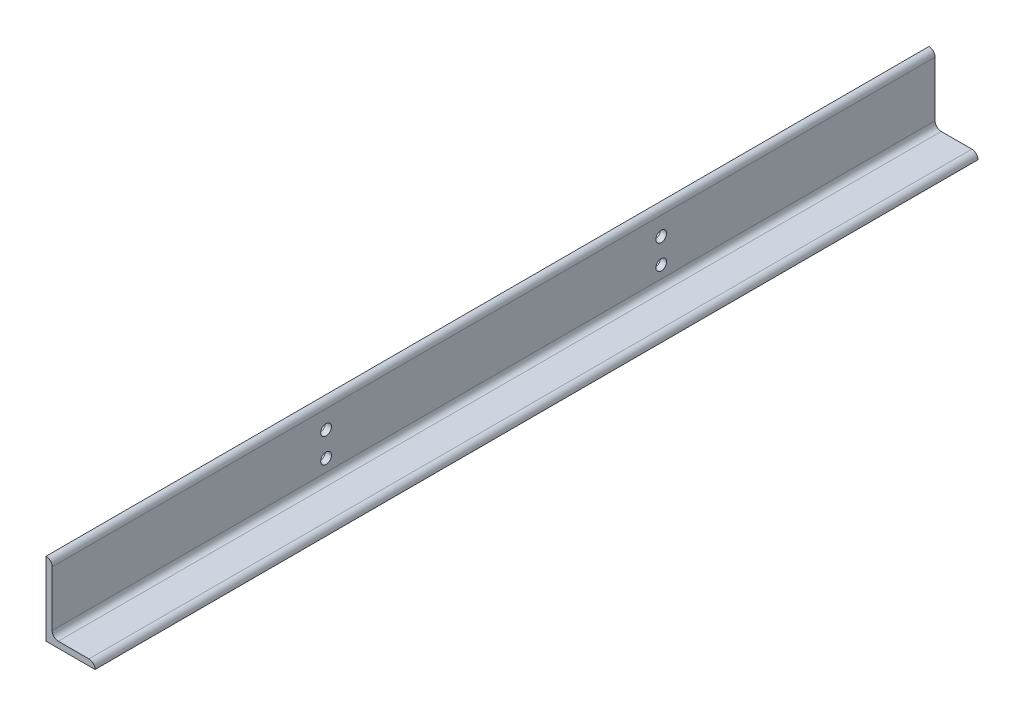
ISO-10303-21;
HEADER;
FILE_DESCRIPTION(('STEP AP214'),'2;1');
FILE_NAME('part.step','',(''),(''),'','','');
FILE_SCHEMA(('AUTOMOTIVE_DESIGN { 1 0 10303 214 1 1 1 1 }'));
ENDSEC;
DATA;
#1=APPLICATION_CONTEXT('core data for automotive mechanical design processes');
#2=APPLICATION_PROTOCOL_DEFINITION('international standard','automotive_design',2000,#1);
#3=PRODUCT_CONTEXT('',#1,'mechanical');
#4=PRODUCT('Part','Part','',(#3));
#5=PRODUCT_RELATED_PRODUCT_CATEGORY('part','',(#4));
#6=PRODUCT_DEFINITION_FORMATION('','',#4);
#7=PRODUCT_DEFINITION_CONTEXT('part definition',#1,'design');
#8=PRODUCT_DEFINITION('design','',#6,#7);
#9=PRODUCT_DEFINITION_SHAPE('','',#8);
#10=(LENGTH_UNIT() NAMED_UNIT(*) SI_UNIT(.MILLI.,.METRE.));
#11=(NAMED_UNIT(*) PLANE_ANGLE_UNIT() SI_UNIT($,.RADIAN.));
#12=(NAMED_UNIT(*) SI_UNIT($,.STERADIAN.) SOLID_ANGLE_UNIT());
#13=UNCERTAINTY_MEASURE_WITH_UNIT(LENGTH_MEASURE(1.E-05),#10,'distance_accuracy_value','');
#14=(GEOMETRIC_REPRESENTATION_CONTEXT(3) GLOBAL_UNCERTAINTY_ASSIGNED_CONTEXT((#13)) GLOBAL_UNIT_ASSIGNED_CONTEXT((#10,
#11,#12)) REPRESENTATION_CONTEXT('',''));
#15=CARTESIAN_POINT('',(0.,0.,0.));
#16=DIRECTION('',(0.,0.,1.));
#17=DIRECTION('',(1.,0.,0.));
#18=AXIS2_PLACEMENT_3D('',#15,#16,#17);
#19=CARTESIAN_POINT('',(101.6,0.,914.4));
#20=DIRECTION('',(0.,1.,0.));
#21=DIRECTION('',(-1.,0.,0.));
#22=AXIS2_PLACEMENT_3D('',#19,#20,#21);
#23=PLANE('',#22);
#24=DIRECTION('',(1.,0.,0.));
#25=VECTOR('',#24,1.);
#26=CARTESIAN_POINT('',(101.6,0.,-914.4));
#27=LINE('',#26,#25);
#28=CARTESIAN_POINT('',(0.,0.,-914.4));
#29=VERTEX_POINT('',#28);
#30=CARTESIAN_POINT('',(101.6,0.,-914.4));
#31=VERTEX_POINT('',#30);
#32=EDGE_CURVE('E137',#29,#31,#27,.T.);
#33=ORIENTED_EDGE('',*,*,#32,.T.);
#34=DIRECTION('',(0.,0.,-1.));
#35=VECTOR('',#34,1.);
#36=CARTESIAN_POINT('',(101.6,0.,914.4));
#37=LINE('',#36,#35);
#38=CARTESIAN_POINT('',(101.6,0.,914.4));
#39=VERTEX_POINT('',#38);
#40=EDGE_CURVE('E11',#39,#31,#37,.T.);
#41=ORIENTED_EDGE('',*,*,#40,.F.);
#42=DIRECTION('',(1.,0.,0.));
#43=VECTOR('',#42,1.);
#44=CARTESIAN_POINT('',(101.6,0.,914.4));
#45=LINE('',#44,#43);
#46=CARTESIAN_POINT('',(0.,0.,914.4));
#47=VERTEX_POINT('',#46);
#48=EDGE_CURVE('E154',#47,#39,#45,.T.);
#49=ORIENTED_EDGE('',*,*,#48,.F.);
#50=DIRECTION('',(0.,0.,-1.));
#51=VECTOR('',#50,1.);
#52=CARTESIAN_POINT('',(0.,0.,914.4));
#53=LINE('',#52,#51);
#54=EDGE_CURVE('E133',#47,#29,#53,.T.);
#55=ORIENTED_EDGE('',*,*,#54,.T.);
#56=EDGE_LOOP('',(#33,#41,#49,#55));
#57=FACE_BOUND('',#56,.T.);
#58=ADVANCED_FACE('F35',(#57),#23,.F.);
#59=CARTESIAN_POINT('',(101.6,0.00508000000000622,914.4));
#60=DIRECTION('',(-1.,0.,0.));
#61=DIRECTION('',(0.,0.,1.));
#62=AXIS2_PLACEMENT_3D('',#59,#60,#61);
#63=PLANE('',#62);
#64=DIRECTION('',(0.,1.,0.));
#65=VECTOR('',#64,1.);
#66=CARTESIAN_POINT('',(101.6,0.00508000000000622,-914.4));
#67=LINE('',#66,#65);
#68=CARTESIAN_POINT('',(101.6,0.00508000000000622,-914.4));
#69=VERTEX_POINT('',#68);
#70=EDGE_CURVE('E140',#31,#69,#67,.T.);
#71=ORIENTED_EDGE('',*,*,#70,.T.);
#72=DIRECTION('',(0.,0.,-1.));
#73=VECTOR('',#72,1.);
#74=CARTESIAN_POINT('',(101.6,0.00508000000000622,914.4));
#75=LINE('',#74,#73);
#76=CARTESIAN_POINT('',(101.6,0.00508000000000622,914.4));
#77=VERTEX_POINT('',#76);
#78=EDGE_CURVE('E43',#77,#69,#75,.T.);
#79=ORIENTED_EDGE('',*,*,#78,.F.);
#80=DIRECTION('',(0.,1.,0.));
#81=VECTOR('',#80,1.);
#82=CARTESIAN_POINT('',(101.6,0.00508000000000622,914.4));
#83=LINE('',#82,#81);
#84=EDGE_CURVE('E97',#39,#77,#83,.T.);
#85=ORIENTED_EDGE('',*,*,#84,.F.);
#86=ORIENTED_EDGE('',*,*,#40,.T.);
#87=EDGE_LOOP('',(#71,#79,#85,#86));
#88=FACE_BOUND('',#87,.T.);
#89=ADVANCED_FACE('F247',(#88),#63,.F.);
#90=CARTESIAN_POINT('',(88.90508,0.00508000000000467,914.4));
#91=DIRECTION('',(0.,0.,-1.));
#92=DIRECTION('',(-1.,0.,0.));
#93=AXIS2_PLACEMENT_3D('',#90,#91,#92);
#94=CYLINDRICAL_SURFACE('',#93,12.69492);
#95=CARTESIAN_POINT('',(88.90508,0.00508000000000467,-914.4));
#96=DIRECTION('',(0.,0.,1.));
#97=DIRECTION('',(1.,0.,0.));
#98=AXIS2_PLACEMENT_3D('',#95,#96,#97);
#99=CIRCLE('',#98,12.69492);
#100=CARTESIAN_POINT('',(88.90508,12.7,-914.4));
#101=VERTEX_POINT('',#100);
#102=EDGE_CURVE('E143',#69,#101,#99,.T.);
#103=ORIENTED_EDGE('',*,*,#102,.T.);
#104=DIRECTION('',(0.,0.,-1.));
#105=VECTOR('',#104,1.);
#106=CARTESIAN_POINT('',(88.90508,12.7,914.4));
#107=LINE('',#106,#105);
#108=CARTESIAN_POINT('',(88.90508,12.7,914.4));
#109=VERTEX_POINT('',#108);
#110=EDGE_CURVE('E164',#109,#101,#107,.T.);
#111=ORIENTED_EDGE('',*,*,#110,.F.);
#112=CARTESIAN_POINT('',(88.90508,0.00508000000000467,914.4));
#113=DIRECTION('',(0.,0.,1.));
#114=DIRECTION('',(1.,0.,0.));
#115=AXIS2_PLACEMENT_3D('',#112,#113,#114);
#116=CIRCLE('',#115,12.69492);
#117=EDGE_CURVE('E172',#77,#109,#116,.T.);
#118=ORIENTED_EDGE('',*,*,#117,.F.);
#119=ORIENTED_EDGE('',*,*,#78,.T.);
#120=EDGE_LOOP('',(#103,#111,#118,#119));
#121=FACE_BOUND('',#120,.T.);
#122=ADVANCED_FACE('F170',(#121),#94,.T.);
#123=CARTESIAN_POINT('',(25.4,12.7,914.4));
#124=DIRECTION('',(0.,-1.,0.));
#125=DIRECTION('',(0.,0.,-1.));
#126=AXIS2_PLACEMENT_3D('',#123,#124,#125);
#127=PLANE('',#126);
#128=DIRECTION('',(-1.,0.,0.));
#129=VECTOR('',#128,1.);
#130=CARTESIAN_POINT('',(25.4,12.7,-914.4));
#131=LINE('',#130,#129);
#132=CARTESIAN_POINT('',(25.4,12.7,-914.4));
#133=VERTEX_POINT('',#132);
#134=EDGE_CURVE('E145',#101,#133,#131,.T.);
#135=ORIENTED_EDGE('',*,*,#134,.T.);
#136=DIRECTION('',(0.,0.,-1.));
#137=VECTOR('',#136,1.);
#138=CARTESIAN_POINT('',(25.4,12.7,914.4));
#139=LINE('',#138,#137);
#140=CARTESIAN_POINT('',(25.4,12.7,914.4));
#141=VERTEX_POINT('',#140);
#142=EDGE_CURVE('E161',#141,#133,#139,.T.);
#143=ORIENTED_EDGE('',*,*,#142,.F.);
#144=DIRECTION('',(-1.,0.,0.));
#145=VECTOR('',#144,1.);
#146=CARTESIAN_POINT('',(25.4,12.7,914.4));
#147=LINE('',#146,#145);
#148=EDGE_CURVE('E188',#109,#141,#147,.T.);
#149=ORIENTED_EDGE('',*,*,#148,.F.);
#150=ORIENTED_EDGE('',*,*,#110,.T.);
#151=EDGE_LOOP('',(#135,#143,#149,#150));
#152=FACE_BOUND('',#151,.T.);
#153=ADVANCED_FACE('F181',(#152),#127,.F.);
#154=CARTESIAN_POINT('',(25.4,25.4,914.4));
#155=DIRECTION('',(0.,0.,-1.));
#156=DIRECTION('',(-1.,0.,0.));
#157=AXIS2_PLACEMENT_3D('',#154,#155,#156);
#158=CYLINDRICAL_SURFACE('',#157,12.7);
#159=CARTESIAN_POINT('',(25.4,25.4,-914.4));
#160=DIRECTION('',(0.,0.,-1.));
#161=DIRECTION('',(-1.,0.,0.));
#162=AXIS2_PLACEMENT_3D('',#159,#160,#161);
#163=CIRCLE('',#162,12.7);
#164=CARTESIAN_POINT('',(12.7,25.4,-914.4));
#165=VERTEX_POINT('',#164);
#166=EDGE_CURVE('E147',#133,#165,#163,.T.);
#167=ORIENTED_EDGE('',*,*,#166,.T.);
#168=DIRECTION('',(0.,0.,-1.));
#169=VECTOR('',#168,1.);
#170=CARTESIAN_POINT('',(12.7,25.4,914.4));
#171=LINE('',#170,#169);
#172=CARTESIAN_POINT('',(12.7,25.4,914.4));
#173=VERTEX_POINT('',#172);
#174=EDGE_CURVE('E158',#173,#165,#171,.T.);
#175=ORIENTED_EDGE('',*,*,#174,.F.);
#176=CARTESIAN_POINT('',(25.4,25.4,914.4));
#177=DIRECTION('',(0.,0.,-1.));
#178=DIRECTION('',(-1.,0.,0.));
#179=AXIS2_PLACEMENT_3D('',#176,#177,#178);
#180=CIRCLE('',#179,12.7);
#181=EDGE_CURVE('E187',#141,#173,#180,.T.);
#182=ORIENTED_EDGE('',*,*,#181,.F.);
#183=ORIENTED_EDGE('',*,*,#142,.T.);
#184=EDGE_LOOP('',(#167,#175,#182,#183));
#185=FACE_BOUND('',#184,.T.);
#186=ADVANCED_FACE('F185',(#185),#158,.F.);
#187=CARTESIAN_POINT('',(12.7,139.70508,914.4));
#188=DIRECTION('',(-1.,0.,0.));
#189=DIRECTION('',(0.,-1.,0.));
#190=AXIS2_PLACEMENT_3D('',#187,#188,#189);
#191=PLANE('',#190);
#192=CARTESIAN_POINT('',(12.7,101.6,-347.218));
#193=DIRECTION('',(-1.,0.,0.));
#194=DIRECTION('',(0.,-1.,0.));
#195=AXIS2_PLACEMENT_3D('',#192,#193,#194);
#196=CIRCLE('',#195,11.1125);
#197=CARTESIAN_POINT('',(12.7,90.4875,-347.218));
#198=VERTEX_POINT('',#197);
#199=EDGE_CURVE('E212',#198,#198,#196,.F.);
#200=ORIENTED_EDGE('',*,*,#199,.F.);
#201=EDGE_LOOP('',(#200));
#202=FACE_BOUND('',#201,.T.);
#203=CARTESIAN_POINT('',(12.7,101.791886097274,346.964));
#204=DIRECTION('',(-1.,0.,0.));
#205=DIRECTION('',(0.,-1.,0.));
#206=AXIS2_PLACEMENT_3D('',#203,#204,#205);
#207=CIRCLE('',#206,11.1125);
#208=CARTESIAN_POINT('',(12.7,90.6793860972742,346.964));
#209=VERTEX_POINT('',#208);
#210=EDGE_CURVE('E206',#209,#209,#207,.F.);
#211=ORIENTED_EDGE('',*,*,#210,.F.);
#212=EDGE_LOOP('',(#211));
#213=FACE_BOUND('',#212,.T.);
#214=CARTESIAN_POINT('',(12.7,50.8,-347.218));
#215=DIRECTION('',(-1.,0.,0.));
#216=DIRECTION('',(0.,-1.,0.));
#217=AXIS2_PLACEMENT_3D('',#214,#215,#216);
#218=CIRCLE('',#217,11.1125);
#219=CARTESIAN_POINT('',(12.7,39.6875,-347.218));
#220=VERTEX_POINT('',#219);
#221=EDGE_CURVE('E200',#220,#220,#218,.F.);
#222=ORIENTED_EDGE('',*,*,#221,.F.);
#223=EDGE_LOOP('',(#222));
#224=FACE_BOUND('',#223,.T.);
#225=CARTESIAN_POINT('',(12.7,50.8,346.964));
#226=DIRECTION('',(-1.,0.,0.));
#227=DIRECTION('',(0.,-1.,0.));
#228=AXIS2_PLACEMENT_3D('',#225,#226,#227);
#229=CIRCLE('',#228,11.1125);
#230=CARTESIAN_POINT('',(12.7,39.6875,346.964));
#231=VERTEX_POINT('',#230);
#232=EDGE_CURVE('E141',#231,#231,#229,.F.);
#233=ORIENTED_EDGE('',*,*,#232,.F.);
#234=EDGE_LOOP('',(#233));
#235=FACE_BOUND('',#234,.T.);
#236=DIRECTION('',(0.,1.,0.));
#237=VECTOR('',#236,1.);
#238=CARTESIAN_POINT('',(12.7,139.70508,-914.4));
#239=LINE('',#238,#237);
#240=CARTESIAN_POINT('',(12.7,139.70508,-914.4));
#241=VERTEX_POINT('',#240);
#242=EDGE_CURVE('E149',#165,#241,#239,.T.);
#243=ORIENTED_EDGE('',*,*,#242,.T.);
#244=DIRECTION('',(0.,0.,-1.));
#245=VECTOR('',#244,1.);
#246=CARTESIAN_POINT('',(12.7,139.70508,914.4));
#247=LINE('',#246,#245);
#248=CARTESIAN_POINT('',(12.7,139.70508,914.4));
#249=VERTEX_POINT('',#248);
#250=EDGE_CURVE('E128',#249,#241,#247,.T.);
#251=ORIENTED_EDGE('',*,*,#250,.F.);
#252=DIRECTION('',(0.,1.,0.));
#253=VECTOR('',#252,1.);
#254=CARTESIAN_POINT('',(12.7,139.70508,914.4));
#255=LINE('',#254,#253);
#256=EDGE_CURVE('E119',#173,#249,#255,.T.);
#257=ORIENTED_EDGE('',*,*,#256,.F.);
#258=ORIENTED_EDGE('',*,*,#174,.T.);
#259=EDGE_LOOP('',(#243,#251,#257,#258));
#260=FACE_BOUND('',#259,.T.);
#261=ADVANCED_FACE('F239',(#202,#213,#224,#235,#260),#191,.F.);
#262=CARTESIAN_POINT('',(0.00508000000000078,139.70508,914.4));
#263=DIRECTION('',(0.,0.,-1.));
#264=DIRECTION('',(-1.,0.,0.));
#265=AXIS2_PLACEMENT_3D('',#262,#263,#264);
#266=CYLINDRICAL_SURFACE('',#265,12.69492);
#267=CARTESIAN_POINT('',(0.00508000000000078,139.70508,-914.4));
#268=DIRECTION('',(0.,0.,1.));
#269=DIRECTION('',(-1.,0.,0.));
#270=AXIS2_PLACEMENT_3D('',#267,#268,#269);
#271=CIRCLE('',#270,12.69492);
#272=CARTESIAN_POINT('',(0.00508,152.4,-914.4));
#273=VERTEX_POINT('',#272);
#274=EDGE_CURVE('E127',#241,#273,#271,.T.);
#275=ORIENTED_EDGE('',*,*,#274,.T.);
#276=DIRECTION('',(0.,0.,-1.));
#277=VECTOR('',#276,1.);
#278=CARTESIAN_POINT('',(0.00508,152.4,914.4));
#279=LINE('',#278,#277);
#280=CARTESIAN_POINT('',(0.00508,152.4,914.4));
#281=VERTEX_POINT('',#280);
#282=EDGE_CURVE('E124',#281,#273,#279,.T.);
#283=ORIENTED_EDGE('',*,*,#282,.F.);
#284=CARTESIAN_POINT('',(0.00508000000000078,139.70508,914.4));
#285=DIRECTION('',(0.,0.,1.));
#286=DIRECTION('',(-1.,0.,0.));
#287=AXIS2_PLACEMENT_3D('',#284,#285,#286);
#288=CIRCLE('',#287,12.69492);
#289=EDGE_CURVE('E113',#249,#281,#288,.T.);
#290=ORIENTED_EDGE('',*,*,#289,.F.);
#291=ORIENTED_EDGE('',*,*,#250,.T.);
#292=EDGE_LOOP('',(#275,#283,#290,#291));
#293=FACE_BOUND('',#292,.T.);
#294=ADVANCED_FACE('F125',(#293),#266,.T.);
#295=CARTESIAN_POINT('',(0.,152.4,914.4));
#296=DIRECTION('',(0.,-1.,0.));
#297=DIRECTION('',(0.,0.,-1.));
#298=AXIS2_PLACEMENT_3D('',#295,#296,#297);
#299=PLANE('',#298);
#300=DIRECTION('',(-1.,0.,0.));
#301=VECTOR('',#300,1.);
#302=CARTESIAN_POINT('',(0.,152.4,-914.4));
#303=LINE('',#302,#301);
#304=CARTESIAN_POINT('',(0.,152.4,-914.4));
#305=VERTEX_POINT('',#304);
#306=EDGE_CURVE('E83',#273,#305,#303,.T.);
#307=ORIENTED_EDGE('',*,*,#306,.T.);
#308=DIRECTION('',(0.,0.,-1.));
#309=VECTOR('',#308,1.);
#310=CARTESIAN_POINT('',(0.,152.4,914.4));
#311=LINE('',#310,#309);
#312=CARTESIAN_POINT('',(0.,152.4,914.4));
#313=VERTEX_POINT('',#312);
#314=EDGE_CURVE('E129',#313,#305,#311,.T.);
#315=ORIENTED_EDGE('',*,*,#314,.F.);
#316=DIRECTION('',(-1.,0.,0.));
#317=VECTOR('',#316,1.);
#318=CARTESIAN_POINT('',(0.,152.4,914.4));
#319=LINE('',#318,#317);
#320=EDGE_CURVE('E117',#281,#313,#319,.T.);
#321=ORIENTED_EDGE('',*,*,#320,.F.);
#322=ORIENTED_EDGE('',*,*,#282,.T.);
#323=EDGE_LOOP('',(#307,#315,#321,#322));
#324=FACE_BOUND('',#323,.T.);
#325=ADVANCED_FACE('F131',(#324),#299,.F.);
#326=CARTESIAN_POINT('',(0.,0.,914.4));
#327=DIRECTION('',(1.,0.,0.));
#328=DIRECTION('',(0.,0.,-1.));
#329=AXIS2_PLACEMENT_3D('',#326,#327,#328);
#330=PLANE('',#329);
#331=CARTESIAN_POINT('',(0.,101.6,-347.218));
#332=DIRECTION('',(-1.,0.,0.));
#333=DIRECTION('',(0.,0.,1.));
#334=AXIS2_PLACEMENT_3D('',#331,#332,#333);
#335=CIRCLE('',#334,11.1125);
#336=CARTESIAN_POINT('',(0.,101.6,-336.1055));
#337=VERTEX_POINT('',#336);
#338=EDGE_CURVE('E215',#337,#337,#335,.T.);
#339=ORIENTED_EDGE('',*,*,#338,.F.);
#340=EDGE_LOOP('',(#339));
#341=FACE_BOUND('',#340,.T.);
#342=CARTESIAN_POINT('',(0.,101.791886097274,346.964));
#343=DIRECTION('',(-1.,0.,0.));
#344=DIRECTION('',(0.,0.,1.));
#345=AXIS2_PLACEMENT_3D('',#342,#343,#344);
#346=CIRCLE('',#345,11.1125);
#347=CARTESIAN_POINT('',(0.,101.791886097274,358.0765));
#348=VERTEX_POINT('',#347);
#349=EDGE_CURVE('E209',#348,#348,#346,.T.);
#350=ORIENTED_EDGE('',*,*,#349,.F.);
#351=EDGE_LOOP('',(#350));
#352=FACE_BOUND('',#351,.T.);
#353=CARTESIAN_POINT('',(0.,50.8,-347.218));
#354=DIRECTION('',(-1.,0.,0.));
#355=DIRECTION('',(0.,0.,1.));
#356=AXIS2_PLACEMENT_3D('',#353,#354,#355);
#357=CIRCLE('',#356,11.1125);
#358=CARTESIAN_POINT('',(0.,50.8,-336.1055));
#359=VERTEX_POINT('',#358);
#360=EDGE_CURVE('E203',#359,#359,#357,.T.);
#361=ORIENTED_EDGE('',*,*,#360,.F.);
#362=EDGE_LOOP('',(#361));
#363=FACE_BOUND('',#362,.T.);
#364=CARTESIAN_POINT('',(0.,50.8,346.964));
#365=DIRECTION('',(-1.,0.,0.));
#366=DIRECTION('',(0.,0.,1.));
#367=AXIS2_PLACEMENT_3D('',#364,#365,#366);
#368=CIRCLE('',#367,11.1125);
#369=CARTESIAN_POINT('',(0.,50.8,358.0765));
#370=VERTEX_POINT('',#369);
#371=EDGE_CURVE('E197',#370,#370,#368,.T.);
#372=ORIENTED_EDGE('',*,*,#371,.F.);
#373=EDGE_LOOP('',(#372));
#374=FACE_BOUND('',#373,.T.);
#375=DIRECTION('',(0.,-1.,0.));
#376=VECTOR('',#375,1.);
#377=CARTESIAN_POINT('',(0.,0.,-914.4));
#378=LINE('',#377,#376);
#379=EDGE_CURVE('E89',#305,#29,#378,.T.);
#380=ORIENTED_EDGE('',*,*,#379,.T.);
#381=ORIENTED_EDGE('',*,*,#54,.F.);
#382=DIRECTION('',(0.,-1.,0.));
#383=VECTOR('',#382,1.);
#384=CARTESIAN_POINT('',(0.,0.,914.4));
#385=LINE('',#384,#383);
#386=EDGE_CURVE('E51',#313,#47,#385,.T.);
#387=ORIENTED_EDGE('',*,*,#386,.F.);
#388=ORIENTED_EDGE('',*,*,#314,.T.);
#389=EDGE_LOOP('',(#380,#381,#387,#388));
#390=FACE_BOUND('',#389,.T.);
#391=ADVANCED_FACE('F222',(#341,#352,#363,#374,#390),#330,.F.);
#392=CARTESIAN_POINT('',(0.00508000000000078,139.70508,914.4));
#393=DIRECTION('',(0.,0.,-1.));
#394=DIRECTION('',(-1.,0.,0.));
#395=AXIS2_PLACEMENT_3D('',#392,#393,#394);
#396=PLANE('',#395);
#397=ORIENTED_EDGE('',*,*,#48,.T.);
#398=ORIENTED_EDGE('',*,*,#84,.T.);
#399=ORIENTED_EDGE('',*,*,#117,.T.);
#400=ORIENTED_EDGE('',*,*,#148,.T.);
#401=ORIENTED_EDGE('',*,*,#181,.T.);
#402=ORIENTED_EDGE('',*,*,#256,.T.);
#403=ORIENTED_EDGE('',*,*,#289,.T.);
#404=ORIENTED_EDGE('',*,*,#320,.T.);
#405=ORIENTED_EDGE('',*,*,#386,.T.);
#406=EDGE_LOOP('',(#397,#398,#399,#400,#401,#402,#403,#404,#405));
#407=FACE_BOUND('',#406,.T.);
#408=ADVANCED_FACE('F115',(#407),#396,.F.);
#409=CARTESIAN_POINT('',(0.00508000000000078,139.70508,-914.4));
#410=DIRECTION('',(0.,0.,-1.));
#411=DIRECTION('',(-1.,0.,0.));
#412=AXIS2_PLACEMENT_3D('',#409,#410,#411);
#413=PLANE('',#412);
#414=ORIENTED_EDGE('',*,*,#32,.F.);
#415=ORIENTED_EDGE('',*,*,#379,.F.);
#416=ORIENTED_EDGE('',*,*,#306,.F.);
#417=ORIENTED_EDGE('',*,*,#274,.F.);
#418=ORIENTED_EDGE('',*,*,#242,.F.);
#419=ORIENTED_EDGE('',*,*,#166,.F.);
#420=ORIENTED_EDGE('',*,*,#134,.F.);
#421=ORIENTED_EDGE('',*,*,#102,.F.);
#422=ORIENTED_EDGE('',*,*,#70,.F.);
#423=EDGE_LOOP('',(#414,#415,#416,#417,#418,#419,#420,#421,#422));
#424=FACE_BOUND('',#423,.T.);
#425=ADVANCED_FACE('F176',(#424),#413,.T.);
#426=CARTESIAN_POINT('',(101.601,50.8,346.964));
#427=DIRECTION('',(-1.,0.,0.));
#428=DIRECTION('',(0.,0.,1.));
#429=AXIS2_PLACEMENT_3D('',#426,#427,#428);
#430=CYLINDRICAL_SURFACE('',#429,11.1125);
#431=ORIENTED_EDGE('',*,*,#371,.T.);
#432=EDGE_LOOP('',(#431));
#433=FACE_BOUND('',#432,.T.);
#434=ORIENTED_EDGE('',*,*,#232,.T.);
#435=EDGE_LOOP('',(#434));
#436=FACE_BOUND('',#435,.T.);
#437=ADVANCED_FACE('F232',(#433,#436),#430,.F.);
#438=CARTESIAN_POINT('',(101.601,50.8,-347.218));
#439=DIRECTION('',(-1.,0.,0.));
#440=DIRECTION('',(0.,0.,1.));
#441=AXIS2_PLACEMENT_3D('',#438,#439,#440);
#442=CYLINDRICAL_SURFACE('',#441,11.1125);
#443=ORIENTED_EDGE('',*,*,#360,.T.);
#444=EDGE_LOOP('',(#443));
#445=FACE_BOUND('',#444,.T.);
#446=ORIENTED_EDGE('',*,*,#221,.T.);
#447=EDGE_LOOP('',(#446));
#448=FACE_BOUND('',#447,.T.);
#449=ADVANCED_FACE('F235',(#445,#448),#442,.F.);
#450=CARTESIAN_POINT('',(101.601,101.791886097274,346.964));
#451=DIRECTION('',(-1.,0.,0.));
#452=DIRECTION('',(0.,0.,1.));
#453=AXIS2_PLACEMENT_3D('',#450,#451,#452);
#454=CYLINDRICAL_SURFACE('',#453,11.1125);
#455=ORIENTED_EDGE('',*,*,#349,.T.);
#456=EDGE_LOOP('',(#455));
#457=FACE_BOUND('',#456,.T.);
#458=ORIENTED_EDGE('',*,*,#210,.T.);
#459=EDGE_LOOP('',(#458));
#460=FACE_BOUND('',#459,.T.);
#461=ADVANCED_FACE('F269',(#457,#460),#454,.F.);
#462=CARTESIAN_POINT('',(101.601,101.6,-347.218));
#463=DIRECTION('',(-1.,0.,0.));
#464=DIRECTION('',(0.,0.,1.));
#465=AXIS2_PLACEMENT_3D('',#462,#463,#464);
#466=CYLINDRICAL_SURFACE('',#465,11.1125);
#467=ORIENTED_EDGE('',*,*,#338,.T.);
#468=EDGE_LOOP('',(#467));
#469=FACE_BOUND('',#468,.T.);
#470=ORIENTED_EDGE('',*,*,#199,.T.);
#471=EDGE_LOOP('',(#470));
#472=FACE_BOUND('',#471,.T.);
#473=ADVANCED_FACE('F219',(#469,#472),#466,.F.);
#474=CLOSED_SHELL('',(#58,#89,#122,#153,#186,#261,#294,#325,#391,#408,#425,#437,#449,#461,#473));
#475=MANIFOLD_SOLID_BREP('B2',#474);
#476=ADVANCED_BREP_SHAPE_REPRESENTATION('',(#18,#475),#14);
#477=SHAPE_DEFINITION_REPRESENTATION(#9,#476);
ENDSEC;
END-ISO-10303-21;
